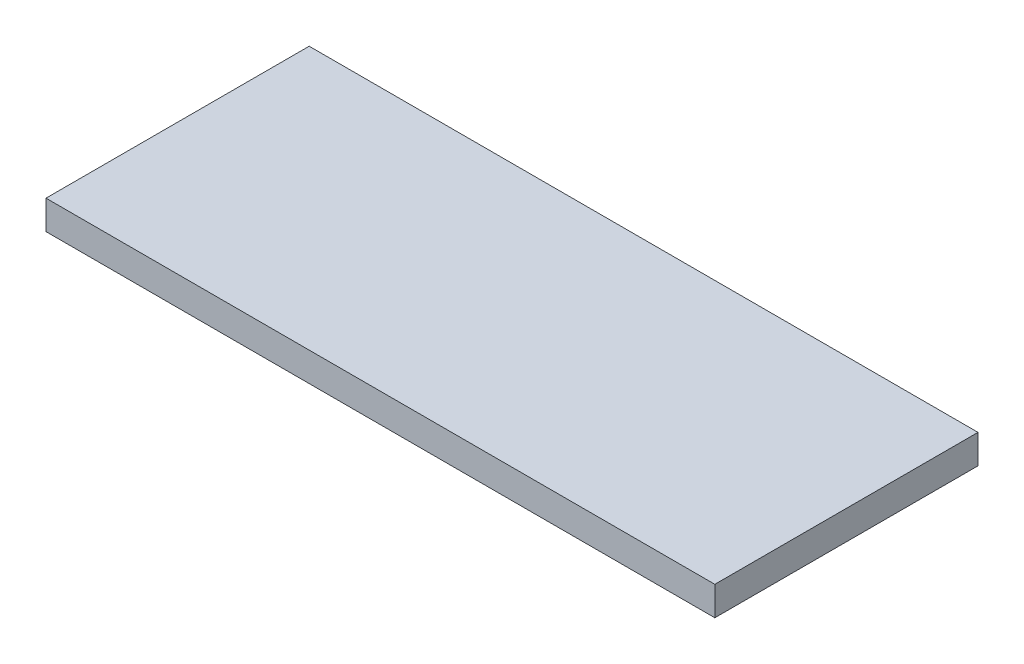
ISO-10303-21;
HEADER;
FILE_DESCRIPTION(('STEP AP214'),'2;1');
FILE_NAME('part.step','',(''),(''),'','','');
FILE_SCHEMA(('AUTOMOTIVE_DESIGN { 1 0 10303 214 1 1 1 1 }'));
ENDSEC;
DATA;
#1=APPLICATION_CONTEXT('core data for automotive mechanical design processes');
#2=APPLICATION_PROTOCOL_DEFINITION('international standard','automotive_design',2000,#1);
#3=PRODUCT_CONTEXT('',#1,'mechanical');
#4=PRODUCT('Part','Part','',(#3));
#5=PRODUCT_RELATED_PRODUCT_CATEGORY('part','',(#4));
#6=PRODUCT_DEFINITION_FORMATION('','',#4);
#7=PRODUCT_DEFINITION_CONTEXT('part definition',#1,'design');
#8=PRODUCT_DEFINITION('design','',#6,#7);
#9=PRODUCT_DEFINITION_SHAPE('','',#8);
#10=(LENGTH_UNIT() NAMED_UNIT(*) SI_UNIT(.MILLI.,.METRE.));
#11=(NAMED_UNIT(*) PLANE_ANGLE_UNIT() SI_UNIT($,.RADIAN.));
#12=(NAMED_UNIT(*) SI_UNIT($,.STERADIAN.) SOLID_ANGLE_UNIT());
#13=UNCERTAINTY_MEASURE_WITH_UNIT(LENGTH_MEASURE(1.E-05),#10,'distance_accuracy_value','');
#14=(GEOMETRIC_REPRESENTATION_CONTEXT(3) GLOBAL_UNCERTAINTY_ASSIGNED_CONTEXT((#13)) GLOBAL_UNIT_ASSIGNED_CONTEXT((#10,
#11,#12)) REPRESENTATION_CONTEXT('',''));
#15=CARTESIAN_POINT('',(0.,0.,0.));
#16=DIRECTION('',(0.,0.,1.));
#17=DIRECTION('',(1.,0.,0.));
#18=AXIS2_PLACEMENT_3D('',#15,#16,#17);
#19=CARTESIAN_POINT('',(0.,18.,0.));
#20=DIRECTION('',(1.,0.,0.));
#21=DIRECTION('',(0.,0.,-1.));
#22=AXIS2_PLACEMENT_3D('',#19,#20,#21);
#23=PLANE('',#22);
#24=DIRECTION('',(0.,0.,1.));
#25=VECTOR('',#24,1.);
#26=CARTESIAN_POINT('',(0.,0.,0.));
#27=LINE('',#26,#25);
#28=CARTESIAN_POINT('',(0.,0.,-163.3));
#29=VERTEX_POINT('',#28);
#30=CARTESIAN_POINT('',(0.,0.,0.));
#31=VERTEX_POINT('',#30);
#32=EDGE_CURVE('E95',#29,#31,#27,.T.);
#33=ORIENTED_EDGE('',*,*,#32,.T.);
#34=DIRECTION('',(0.,-1.,0.));
#35=VECTOR('',#34,1.);
#36=CARTESIAN_POINT('',(0.,18.,0.));
#37=LINE('',#36,#35);
#38=CARTESIAN_POINT('',(0.,18.,0.));
#39=VERTEX_POINT('',#38);
#40=EDGE_CURVE('E11',#39,#31,#37,.T.);
#41=ORIENTED_EDGE('',*,*,#40,.F.);
#42=DIRECTION('',(0.,0.,1.));
#43=VECTOR('',#42,1.);
#44=CARTESIAN_POINT('',(0.,18.,0.));
#45=LINE('',#44,#43);
#46=CARTESIAN_POINT('',(0.,18.,-163.3));
#47=VERTEX_POINT('',#46);
#48=EDGE_CURVE('E83',#47,#39,#45,.T.);
#49=ORIENTED_EDGE('',*,*,#48,.F.);
#50=DIRECTION('',(0.,-1.,0.));
#51=VECTOR('',#50,1.);
#52=CARTESIAN_POINT('',(0.,18.,-163.3));
#53=LINE('',#52,#51);
#54=EDGE_CURVE('E91',#47,#29,#53,.T.);
#55=ORIENTED_EDGE('',*,*,#54,.T.);
#56=EDGE_LOOP('',(#33,#41,#49,#55));
#57=FACE_BOUND('',#56,.T.);
#58=ADVANCED_FACE('F32',(#57),#23,.F.);
#59=CARTESIAN_POINT('',(0.,18.,0.));
#60=DIRECTION('',(0.,0.,-1.));
#61=DIRECTION('',(-1.,0.,0.));
#62=AXIS2_PLACEMENT_3D('',#59,#60,#61);
#63=PLANE('',#62);
#64=DIRECTION('',(1.,0.,0.));
#65=VECTOR('',#64,1.);
#66=CARTESIAN_POINT('',(0.,0.,0.));
#67=LINE('',#66,#65);
#68=CARTESIAN_POINT('',(415.,0.,0.));
#69=VERTEX_POINT('',#68);
#70=EDGE_CURVE('E87',#31,#69,#67,.T.);
#71=ORIENTED_EDGE('',*,*,#70,.T.);
#72=DIRECTION('',(0.,-1.,0.));
#73=VECTOR('',#72,1.);
#74=CARTESIAN_POINT('',(415.,18.,0.));
#75=LINE('',#74,#73);
#76=CARTESIAN_POINT('',(415.,18.,0.));
#77=VERTEX_POINT('',#76);
#78=EDGE_CURVE('E40',#77,#69,#75,.T.);
#79=ORIENTED_EDGE('',*,*,#78,.F.);
#80=DIRECTION('',(1.,0.,0.));
#81=VECTOR('',#80,1.);
#82=CARTESIAN_POINT('',(0.,18.,0.));
#83=LINE('',#82,#81);
#84=EDGE_CURVE('E78',#39,#77,#83,.T.);
#85=ORIENTED_EDGE('',*,*,#84,.F.);
#86=ORIENTED_EDGE('',*,*,#40,.T.);
#87=EDGE_LOOP('',(#71,#79,#85,#86));
#88=FACE_BOUND('',#87,.T.);
#89=ADVANCED_FACE('F86',(#88),#63,.F.);
#90=CARTESIAN_POINT('',(415.,18.,0.));
#91=DIRECTION('',(-1.,0.,0.));
#92=DIRECTION('',(0.,0.,1.));
#93=AXIS2_PLACEMENT_3D('',#90,#91,#92);
#94=PLANE('',#93);
#95=DIRECTION('',(0.,0.,-1.));
#96=VECTOR('',#95,1.);
#97=CARTESIAN_POINT('',(415.,0.,0.));
#98=LINE('',#97,#96);
#99=CARTESIAN_POINT('',(415.,0.,-163.3));
#100=VERTEX_POINT('',#99);
#101=EDGE_CURVE('E65',#69,#100,#98,.T.);
#102=ORIENTED_EDGE('',*,*,#101,.T.);
#103=DIRECTION('',(0.,-1.,0.));
#104=VECTOR('',#103,1.);
#105=CARTESIAN_POINT('',(415.,18.,-163.3));
#106=LINE('',#105,#104);
#107=CARTESIAN_POINT('',(415.,18.,-163.3));
#108=VERTEX_POINT('',#107);
#109=EDGE_CURVE('E88',#108,#100,#106,.T.);
#110=ORIENTED_EDGE('',*,*,#109,.F.);
#111=DIRECTION('',(0.,0.,-1.));
#112=VECTOR('',#111,1.);
#113=CARTESIAN_POINT('',(415.,18.,0.));
#114=LINE('',#113,#112);
#115=EDGE_CURVE('E81',#77,#108,#114,.T.);
#116=ORIENTED_EDGE('',*,*,#115,.F.);
#117=ORIENTED_EDGE('',*,*,#78,.T.);
#118=EDGE_LOOP('',(#102,#110,#116,#117));
#119=FACE_BOUND('',#118,.T.);
#120=ADVANCED_FACE('F89',(#119),#94,.F.);
#121=CARTESIAN_POINT('',(0.,18.,-163.3));
#122=DIRECTION('',(0.,0.,1.));
#123=DIRECTION('',(1.,0.,0.));
#124=AXIS2_PLACEMENT_3D('',#121,#122,#123);
#125=PLANE('',#124);
#126=DIRECTION('',(-1.,0.,0.));
#127=VECTOR('',#126,1.);
#128=CARTESIAN_POINT('',(0.,0.,-163.3));
#129=LINE('',#128,#127);
#130=EDGE_CURVE('E71',#100,#29,#129,.T.);
#131=ORIENTED_EDGE('',*,*,#130,.T.);
#132=ORIENTED_EDGE('',*,*,#54,.F.);
#133=DIRECTION('',(-1.,0.,0.));
#134=VECTOR('',#133,1.);
#135=CARTESIAN_POINT('',(0.,18.,-163.3));
#136=LINE('',#135,#134);
#137=EDGE_CURVE('E48',#108,#47,#136,.T.);
#138=ORIENTED_EDGE('',*,*,#137,.F.);
#139=ORIENTED_EDGE('',*,*,#109,.T.);
#140=EDGE_LOOP('',(#131,#132,#138,#139));
#141=FACE_BOUND('',#140,.T.);
#142=ADVANCED_FACE('F102',(#141),#125,.F.);
#143=CARTESIAN_POINT('',(0.,18.,0.));
#144=DIRECTION('',(0.,-1.,0.));
#145=DIRECTION('',(0.,0.,-1.));
#146=AXIS2_PLACEMENT_3D('',#143,#144,#145);
#147=PLANE('',#146);
#148=ORIENTED_EDGE('',*,*,#48,.T.);
#149=ORIENTED_EDGE('',*,*,#84,.T.);
#150=ORIENTED_EDGE('',*,*,#115,.T.);
#151=ORIENTED_EDGE('',*,*,#137,.T.);
#152=EDGE_LOOP('',(#148,#149,#150,#151));
#153=FACE_BOUND('',#152,.T.);
#154=ADVANCED_FACE('F79',(#153),#147,.F.);
#155=CARTESIAN_POINT('',(0.,0.,0.));
#156=DIRECTION('',(0.,-1.,0.));
#157=DIRECTION('',(0.,0.,-1.));
#158=AXIS2_PLACEMENT_3D('',#155,#156,#157);
#159=PLANE('',#158);
#160=ORIENTED_EDGE('',*,*,#32,.F.);
#161=ORIENTED_EDGE('',*,*,#130,.F.);
#162=ORIENTED_EDGE('',*,*,#101,.F.);
#163=ORIENTED_EDGE('',*,*,#70,.F.);
#164=EDGE_LOOP('',(#160,#161,#162,#163));
#165=FACE_BOUND('',#164,.T.);
#166=ADVANCED_FACE('F105',(#165),#159,.T.);
#167=CLOSED_SHELL('',(#58,#89,#120,#142,#154,#166));
#168=MANIFOLD_SOLID_BREP('B2',#167);
#169=ADVANCED_BREP_SHAPE_REPRESENTATION('',(#18,#168),#14);
#170=SHAPE_DEFINITION_REPRESENTATION(#9,#169);
ENDSEC;
END-ISO-10303-21;
